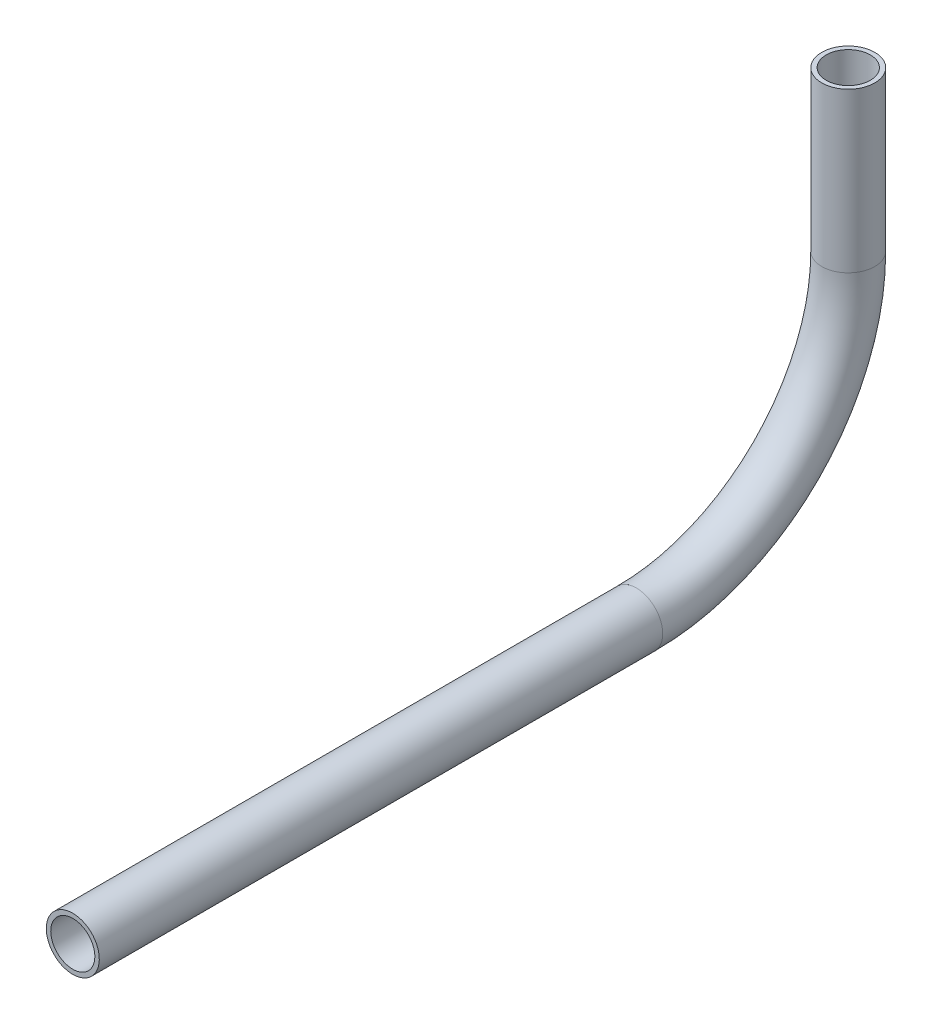
ISO-10303-21;
HEADER;
FILE_DESCRIPTION(('STEP AP214'),'2;1');
FILE_NAME('part.step','',(''),(''),'','','');
FILE_SCHEMA(('AUTOMOTIVE_DESIGN { 1 0 10303 214 1 1 1 1 }'));
ENDSEC;
DATA;
#1=APPLICATION_CONTEXT('core data for automotive mechanical design processes');
#2=APPLICATION_PROTOCOL_DEFINITION('international standard','automotive_design',2000,#1);
#3=PRODUCT_CONTEXT('',#1,'mechanical');
#4=PRODUCT('Part','Part','',(#3));
#5=PRODUCT_RELATED_PRODUCT_CATEGORY('part','',(#4));
#6=PRODUCT_DEFINITION_FORMATION('','',#4);
#7=PRODUCT_DEFINITION_CONTEXT('part definition',#1,'design');
#8=PRODUCT_DEFINITION('design','',#6,#7);
#9=PRODUCT_DEFINITION_SHAPE('','',#8);
#10=(LENGTH_UNIT() NAMED_UNIT(*) SI_UNIT(.MILLI.,.METRE.));
#11=(NAMED_UNIT(*) PLANE_ANGLE_UNIT() SI_UNIT($,.RADIAN.));
#12=(NAMED_UNIT(*) SI_UNIT($,.STERADIAN.) SOLID_ANGLE_UNIT());
#13=UNCERTAINTY_MEASURE_WITH_UNIT(LENGTH_MEASURE(1.E-05),#10,'distance_accuracy_value','');
#14=(GEOMETRIC_REPRESENTATION_CONTEXT(3) GLOBAL_UNCERTAINTY_ASSIGNED_CONTEXT((#13)) GLOBAL_UNIT_ASSIGNED_CONTEXT((#10,
#11,#12)) REPRESENTATION_CONTEXT('',''));
#15=CARTESIAN_POINT('',(0.,0.,0.));
#16=DIRECTION('',(0.,0.,1.));
#17=DIRECTION('',(1.,0.,0.));
#18=AXIS2_PLACEMENT_3D('',#15,#16,#17);
#19=CARTESIAN_POINT('',(0.,670.165576631268,168.173580131087));
#20=DIRECTION('',(0.,0.,1.));
#21=DIRECTION('',(0.,-1.,0.));
#22=AXIS2_PLACEMENT_3D('',#19,#20,#21);
#23=CYLINDRICAL_SURFACE('',#22,5.28320000000004);
#24=CARTESIAN_POINT('',(0.,670.165576631268,303.16459571102));
#25=DIRECTION('',(0.,0.,-1.));
#26=DIRECTION('',(0.,1.,0.));
#27=AXIS2_PLACEMENT_3D('',#24,#25,#26);
#28=CIRCLE('',#27,5.28320000000004);
#29=CARTESIAN_POINT('',(0.,675.448776631268,303.16459571102));
#30=VERTEX_POINT('',#29);
#31=EDGE_CURVE('E55',#30,#30,#28,.T.);
#32=ORIENTED_EDGE('',*,*,#31,.F.);
#33=EDGE_LOOP('',(#32));
#34=FACE_BOUND('',#33,.T.);
#35=CARTESIAN_POINT('',(0.,670.165576631268,168.173580131087));
#36=DIRECTION('',(0.,0.,-1.));
#37=DIRECTION('',(0.,1.,0.));
#38=AXIS2_PLACEMENT_3D('',#35,#36,#37);
#39=CIRCLE('',#38,5.28320000000004);
#40=CARTESIAN_POINT('',(0.,675.448776631268,168.173580131087));
#41=VERTEX_POINT('',#40);
#42=EDGE_CURVE('E51',#41,#41,#39,.T.);
#43=ORIENTED_EDGE('',*,*,#42,.T.);
#44=EDGE_LOOP('',(#43));
#45=FACE_BOUND('',#44,.T.);
#46=ADVANCED_FACE('F47',(#34,#45),#23,.F.);
#47=CARTESIAN_POINT('',(0.,670.165576631268,168.173580131087));
#48=DIRECTION('',(0.,0.,1.));
#49=DIRECTION('',(0.,-1.,0.));
#50=AXIS2_PLACEMENT_3D('',#47,#48,#49);
#51=CYLINDRICAL_SURFACE('',#50,6.35000000000005);
#52=CARTESIAN_POINT('',(0.,670.165576631268,303.16459571102));
#53=DIRECTION('',(0.,0.,-1.));
#54=DIRECTION('',(0.,1.,0.));
#55=AXIS2_PLACEMENT_3D('',#52,#53,#54);
#56=CIRCLE('',#55,6.35000000000005);
#57=CARTESIAN_POINT('',(0.,676.515576631268,303.16459571102));
#58=VERTEX_POINT('',#57);
#59=EDGE_CURVE('E59',#58,#58,#56,.T.);
#60=ORIENTED_EDGE('',*,*,#59,.T.);
#61=EDGE_LOOP('',(#60));
#62=FACE_BOUND('',#61,.T.);
#63=CARTESIAN_POINT('',(0.,670.165576631268,168.173580131087));
#64=DIRECTION('',(0.,0.,-1.));
#65=DIRECTION('',(0.,1.,0.));
#66=AXIS2_PLACEMENT_3D('',#63,#64,#65);
#67=CIRCLE('',#66,6.35000000000005);
#68=CARTESIAN_POINT('',(0.,676.515576631268,168.173580131087));
#69=VERTEX_POINT('',#68);
#70=EDGE_CURVE('E12',#69,#69,#67,.T.);
#71=ORIENTED_EDGE('',*,*,#70,.F.);
#72=EDGE_LOOP('',(#71));
#73=FACE_BOUND('',#72,.T.);
#74=ADVANCED_FACE('F74',(#62,#73),#51,.T.);
#75=CARTESIAN_POINT('',(0.,670.165576631268,303.16459571102));
#76=DIRECTION('',(0.,0.,-1.));
#77=DIRECTION('',(0.,1.,0.));
#78=AXIS2_PLACEMENT_3D('',#75,#76,#77);
#79=PLANE('',#78);
#80=ORIENTED_EDGE('',*,*,#31,.T.);
#81=EDGE_LOOP('',(#80));
#82=FACE_BOUND('',#81,.T.);
#83=ORIENTED_EDGE('',*,*,#59,.F.);
#84=EDGE_LOOP('',(#83));
#85=FACE_BOUND('',#84,.T.);
#86=ADVANCED_FACE('F70',(#82,#85),#79,.F.);
#87=CARTESIAN_POINT('',(0.,670.165576631268,168.173580131087));
#88=DIRECTION('',(0.,0.,-1.));
#89=DIRECTION('',(0.,1.,0.));
#90=AXIS2_PLACEMENT_3D('',#87,#88,#89);
#91=PLANE('',#90);
#92=ORIENTED_EDGE('',*,*,#42,.F.);
#93=EDGE_LOOP('',(#92));
#94=FACE_BOUND('',#93,.T.);
#95=ORIENTED_EDGE('',*,*,#70,.T.);
#96=EDGE_LOOP('',(#95));
#97=FACE_BOUND('',#96,.T.);
#98=ADVANCED_FACE('F49',(#94,#97),#91,.T.);
#99=CLOSED_SHELL('',(#46,#74,#86,#98));
#100=MANIFOLD_SOLID_BREP('B2',#99);
#101=CARTESIAN_POINT('',(0.,720.965576631268,168.173580131087));
#102=DIRECTION('',(-1.,0.,0.));
#103=DIRECTION('',(0.,0.,1.));
#104=AXIS2_PLACEMENT_3D('',#101,#102,#103);
#105=TOROIDAL_SURFACE('',#104,50.8000000000001,5.28320000000004);
#106=CARTESIAN_POINT('',(0.,720.965576631268,117.373580131087));
#107=DIRECTION('',(0.,1.,0.));
#108=DIRECTION('',(0.,0.,1.));
#109=AXIS2_PLACEMENT_3D('',#106,#107,#108);
#110=CIRCLE('',#109,5.28320000000004);
#111=CARTESIAN_POINT('',(0.,720.965576631268,112.090380131087));
#112=VERTEX_POINT('',#111);
#113=EDGE_CURVE('E150',#112,#112,#110,.T.);
#114=CARTESIAN_POINT('',(0.,670.165576631268,168.173580131087));
#115=DIRECTION('',(0.,0.,1.));
#116=DIRECTION('',(0.,-1.,0.));
#117=AXIS2_PLACEMENT_3D('',#114,#115,#116);
#118=CIRCLE('',#117,5.28320000000004);
#119=CARTESIAN_POINT('',(0.,664.882376631268,168.173580131087));
#120=VERTEX_POINT('',#119);
#121=EDGE_CURVE('E140',#120,#120,#118,.T.);
#122=CARTESIAN_POINT('',(0.,720.965576631268,168.173580131087));
#123=DIRECTION('',(-1.,0.,0.));
#124=DIRECTION('',(0.,0.,1.));
#125=AXIS2_PLACEMENT_3D('',#122,#123,#124);
#126=CIRCLE('',#125,56.0832000000001);
#127=EDGE_CURVE('',#112,#120,#126,.T.);
#128=ORIENTED_EDGE('',*,*,#113,.T.);
#129=ORIENTED_EDGE('',*,*,#121,.T.);
#130=ORIENTED_EDGE('',*,*,#127,.T.);
#131=ORIENTED_EDGE('',*,*,#127,.F.);
#132=EDGE_LOOP('',(#128,#130,#129,#131));
#133=FACE_BOUND('',#132,.T.);
#134=ADVANCED_FACE('F136',(#133),#105,.F.);
#135=CARTESIAN_POINT('',(0.,720.965576631268,168.173580131087));
#136=DIRECTION('',(-1.,0.,0.));
#137=DIRECTION('',(0.,0.,1.));
#138=AXIS2_PLACEMENT_3D('',#135,#136,#137);
#139=TOROIDAL_SURFACE('',#138,50.8000000000001,6.35000000000005);
#140=CARTESIAN_POINT('',(0.,720.965576631268,117.373580131087));
#141=DIRECTION('',(0.,1.,0.));
#142=DIRECTION('',(0.,0.,1.));
#143=AXIS2_PLACEMENT_3D('',#140,#141,#142);
#144=CIRCLE('',#143,6.35000000000005);
#145=CARTESIAN_POINT('',(0.,720.965576631268,111.023580131087));
#146=VERTEX_POINT('',#145);
#147=EDGE_CURVE('E144',#146,#146,#144,.T.);
#148=CARTESIAN_POINT('',(0.,670.165576631268,168.173580131087));
#149=DIRECTION('',(0.,0.,1.));
#150=DIRECTION('',(0.,-1.,0.));
#151=AXIS2_PLACEMENT_3D('',#148,#149,#150);
#152=CIRCLE('',#151,6.35000000000005);
#153=CARTESIAN_POINT('',(0.,663.815576631268,168.173580131087));
#154=VERTEX_POINT('',#153);
#155=EDGE_CURVE('E46',#154,#154,#152,.T.);
#156=CARTESIAN_POINT('',(0.,720.965576631268,168.173580131087));
#157=DIRECTION('',(-1.,0.,0.));
#158=DIRECTION('',(0.,0.,1.));
#159=AXIS2_PLACEMENT_3D('',#156,#157,#158);
#160=CIRCLE('',#159,57.1500000000001);
#161=EDGE_CURVE('',#146,#154,#160,.T.);
#162=ORIENTED_EDGE('',*,*,#147,.F.);
#163=ORIENTED_EDGE('',*,*,#155,.F.);
#164=ORIENTED_EDGE('',*,*,#161,.T.);
#165=ORIENTED_EDGE('',*,*,#161,.F.);
#166=EDGE_LOOP('',(#162,#164,#163,#165));
#167=FACE_BOUND('',#166,.T.);
#168=ADVANCED_FACE('F163',(#167),#139,.T.);
#169=CARTESIAN_POINT('',(0.,720.965576631268,117.373580131087));
#170=DIRECTION('',(0.,1.,0.));
#171=DIRECTION('',(0.,0.,1.));
#172=AXIS2_PLACEMENT_3D('',#169,#170,#171);
#173=PLANE('',#172);
#174=ORIENTED_EDGE('',*,*,#113,.F.);
#175=EDGE_LOOP('',(#174));
#176=FACE_BOUND('',#175,.T.);
#177=ORIENTED_EDGE('',*,*,#147,.T.);
#178=EDGE_LOOP('',(#177));
#179=FACE_BOUND('',#178,.T.);
#180=ADVANCED_FACE('F159',(#176,#179),#173,.T.);
#181=CARTESIAN_POINT('',(0.,670.165576631268,168.173580131087));
#182=DIRECTION('',(0.,0.,1.));
#183=DIRECTION('',(0.,-1.,0.));
#184=AXIS2_PLACEMENT_3D('',#181,#182,#183);
#185=PLANE('',#184);
#186=ORIENTED_EDGE('',*,*,#121,.F.);
#187=EDGE_LOOP('',(#186));
#188=FACE_BOUND('',#187,.T.);
#189=ORIENTED_EDGE('',*,*,#155,.T.);
#190=EDGE_LOOP('',(#189));
#191=FACE_BOUND('',#190,.T.);
#192=ADVANCED_FACE('F138',(#188,#191),#185,.T.);
#193=CLOSED_SHELL('',(#134,#168,#180,#192));
#194=MANIFOLD_SOLID_BREP('B7',#193);
#195=CARTESIAN_POINT('',(0.,759.065576631268,117.373580131087));
#196=DIRECTION('',(0.,-1.,0.));
#197=DIRECTION('',(0.,0.,-1.));
#198=AXIS2_PLACEMENT_3D('',#195,#196,#197);
#199=CYLINDRICAL_SURFACE('',#198,5.28320000000004);
#200=CARTESIAN_POINT('',(0.,759.065576631268,117.373580131087));
#201=DIRECTION('',(0.,1.,0.));
#202=DIRECTION('',(0.,0.,1.));
#203=AXIS2_PLACEMENT_3D('',#200,#201,#202);
#204=CIRCLE('',#203,5.28320000000004);
#205=CARTESIAN_POINT('',(0.,759.065576631268,122.656780131087));
#206=VERTEX_POINT('',#205);
#207=EDGE_CURVE('E234',#206,#206,#204,.T.);
#208=ORIENTED_EDGE('',*,*,#207,.T.);
#209=EDGE_LOOP('',(#208));
#210=FACE_BOUND('',#209,.T.);
#211=CARTESIAN_POINT('',(0.,720.965576631268,117.373580131087));
#212=DIRECTION('',(0.,-1.,0.));
#213=DIRECTION('',(0.,0.,-1.));
#214=AXIS2_PLACEMENT_3D('',#211,#212,#213);
#215=CIRCLE('',#214,5.28320000000004);
#216=CARTESIAN_POINT('',(0.,720.965576631268,112.090380131087));
#217=VERTEX_POINT('',#216);
#218=EDGE_CURVE('E224',#217,#217,#215,.T.);
#219=ORIENTED_EDGE('',*,*,#218,.T.);
#220=EDGE_LOOP('',(#219));
#221=FACE_BOUND('',#220,.T.);
#222=ADVANCED_FACE('F220',(#210,#221),#199,.F.);
#223=CARTESIAN_POINT('',(0.,759.065576631268,117.373580131087));
#224=DIRECTION('',(0.,-1.,0.));
#225=DIRECTION('',(0.,0.,-1.));
#226=AXIS2_PLACEMENT_3D('',#223,#224,#225);
#227=CYLINDRICAL_SURFACE('',#226,6.35000000000005);
#228=CARTESIAN_POINT('',(0.,759.065576631268,117.373580131087));
#229=DIRECTION('',(0.,1.,0.));
#230=DIRECTION('',(0.,0.,1.));
#231=AXIS2_PLACEMENT_3D('',#228,#229,#230);
#232=CIRCLE('',#231,6.35000000000005);
#233=CARTESIAN_POINT('',(0.,759.065576631268,123.723580131087));
#234=VERTEX_POINT('',#233);
#235=EDGE_CURVE('E228',#234,#234,#232,.T.);
#236=ORIENTED_EDGE('',*,*,#235,.F.);
#237=EDGE_LOOP('',(#236));
#238=FACE_BOUND('',#237,.T.);
#239=CARTESIAN_POINT('',(0.,720.965576631268,117.373580131087));
#240=DIRECTION('',(0.,-1.,0.));
#241=DIRECTION('',(0.,0.,-1.));
#242=AXIS2_PLACEMENT_3D('',#239,#240,#241);
#243=CIRCLE('',#242,6.35000000000005);
#244=CARTESIAN_POINT('',(0.,720.965576631268,111.023580131087));
#245=VERTEX_POINT('',#244);
#246=EDGE_CURVE('E135',#245,#245,#243,.T.);
#247=ORIENTED_EDGE('',*,*,#246,.F.);
#248=EDGE_LOOP('',(#247));
#249=FACE_BOUND('',#248,.T.);
#250=ADVANCED_FACE('F247',(#238,#249),#227,.T.);
#251=CARTESIAN_POINT('',(0.,759.065576631268,117.373580131087));
#252=DIRECTION('',(0.,1.,0.));
#253=DIRECTION('',(0.,0.,1.));
#254=AXIS2_PLACEMENT_3D('',#251,#252,#253);
#255=PLANE('',#254);
#256=ORIENTED_EDGE('',*,*,#207,.F.);
#257=EDGE_LOOP('',(#256));
#258=FACE_BOUND('',#257,.T.);
#259=ORIENTED_EDGE('',*,*,#235,.T.);
#260=EDGE_LOOP('',(#259));
#261=FACE_BOUND('',#260,.T.);
#262=ADVANCED_FACE('F243',(#258,#261),#255,.T.);
#263=CARTESIAN_POINT('',(0.,720.965576631268,117.373580131087));
#264=DIRECTION('',(0.,-1.,0.));
#265=DIRECTION('',(0.,0.,-1.));
#266=AXIS2_PLACEMENT_3D('',#263,#264,#265);
#267=PLANE('',#266);
#268=ORIENTED_EDGE('',*,*,#218,.F.);
#269=EDGE_LOOP('',(#268));
#270=FACE_BOUND('',#269,.T.);
#271=ORIENTED_EDGE('',*,*,#246,.T.);
#272=EDGE_LOOP('',(#271));
#273=FACE_BOUND('',#272,.T.);
#274=ADVANCED_FACE('F222',(#270,#273),#267,.T.);
#275=CLOSED_SHELL('',(#222,#250,#262,#274));
#276=MANIFOLD_SOLID_BREP('B41',#275);
#277=ADVANCED_BREP_SHAPE_REPRESENTATION('',(#18,#100,#194,#276),#14);
#278=SHAPE_DEFINITION_REPRESENTATION(#9,#277);
ENDSEC;
END-ISO-10303-21;
